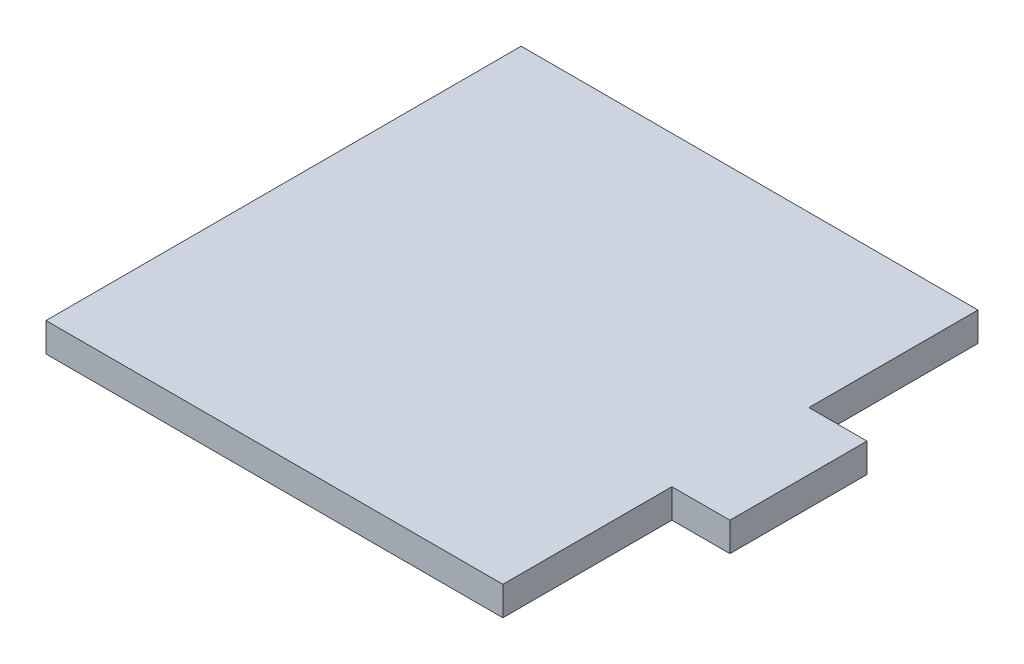
ISO-10303-21;
HEADER;
FILE_DESCRIPTION(('STEP AP214'),'2;1');
FILE_NAME('part.step','',(''),(''),'','','');
FILE_SCHEMA(('AUTOMOTIVE_DESIGN { 1 0 10303 214 1 1 1 1 }'));
ENDSEC;
DATA;
#1=APPLICATION_CONTEXT('core data for automotive mechanical design processes');
#2=APPLICATION_PROTOCOL_DEFINITION('international standard','automotive_design',2000,#1);
#3=PRODUCT_CONTEXT('',#1,'mechanical');
#4=PRODUCT('Part','Part','',(#3));
#5=PRODUCT_RELATED_PRODUCT_CATEGORY('part','',(#4));
#6=PRODUCT_DEFINITION_FORMATION('','',#4);
#7=PRODUCT_DEFINITION_CONTEXT('part definition',#1,'design');
#8=PRODUCT_DEFINITION('design','',#6,#7);
#9=PRODUCT_DEFINITION_SHAPE('','',#8);
#10=(LENGTH_UNIT() NAMED_UNIT(*) SI_UNIT(.MILLI.,.METRE.));
#11=(NAMED_UNIT(*) PLANE_ANGLE_UNIT() SI_UNIT($,.RADIAN.));
#12=(NAMED_UNIT(*) SI_UNIT($,.STERADIAN.) SOLID_ANGLE_UNIT());
#13=UNCERTAINTY_MEASURE_WITH_UNIT(LENGTH_MEASURE(1.E-05),#10,'distance_accuracy_value','');
#14=(GEOMETRIC_REPRESENTATION_CONTEXT(3) GLOBAL_UNCERTAINTY_ASSIGNED_CONTEXT((#13)) GLOBAL_UNIT_ASSIGNED_CONTEXT((#10,
#11,#12)) REPRESENTATION_CONTEXT('',''));
#15=CARTESIAN_POINT('',(0.,0.,0.));
#16=DIRECTION('',(0.,0.,1.));
#17=DIRECTION('',(1.,0.,0.));
#18=AXIS2_PLACEMENT_3D('',#15,#16,#17);
#19=CARTESIAN_POINT('',(-25.,3.175,0.));
#20=DIRECTION('',(-1.,0.,0.));
#21=DIRECTION('',(0.,0.,1.));
#22=AXIS2_PLACEMENT_3D('',#19,#20,#21);
#23=PLANE('',#22);
#24=DIRECTION('',(0.,0.,-1.));
#25=VECTOR('',#24,1.);
#26=CARTESIAN_POINT('',(-25.,0.,0.));
#27=LINE('',#26,#25);
#28=CARTESIAN_POINT('',(-25.,0.,33.5));
#29=VERTEX_POINT('',#28);
#30=CARTESIAN_POINT('',(-25.,0.,-18.5));
#31=VERTEX_POINT('',#30);
#32=EDGE_CURVE('E127',#29,#31,#27,.T.);
#33=ORIENTED_EDGE('',*,*,#32,.F.);
#34=DIRECTION('',(0.,-1.,0.));
#35=VECTOR('',#34,1.);
#36=CARTESIAN_POINT('',(-25.,3.175,33.5));
#37=LINE('',#36,#35);
#38=CARTESIAN_POINT('',(-25.,3.175,33.5));
#39=VERTEX_POINT('',#38);
#40=EDGE_CURVE('E11',#39,#29,#37,.T.);
#41=ORIENTED_EDGE('',*,*,#40,.F.);
#42=DIRECTION('',(0.,0.,-1.));
#43=VECTOR('',#42,1.);
#44=CARTESIAN_POINT('',(-25.,3.175,0.));
#45=LINE('',#44,#43);
#46=CARTESIAN_POINT('',(-25.,3.175,-18.5));
#47=VERTEX_POINT('',#46);
#48=EDGE_CURVE('E147',#39,#47,#45,.T.);
#49=ORIENTED_EDGE('',*,*,#48,.T.);
#50=DIRECTION('',(0.,-1.,0.));
#51=VECTOR('',#50,1.);
#52=CARTESIAN_POINT('',(-25.,3.175,-18.5));
#53=LINE('',#52,#51);
#54=EDGE_CURVE('E50',#47,#31,#53,.T.);
#55=ORIENTED_EDGE('',*,*,#54,.T.);
#56=EDGE_LOOP('',(#33,#41,#49,#55));
#57=FACE_BOUND('',#56,.T.);
#58=ADVANCED_FACE('F34',(#57),#23,.T.);
#59=CARTESIAN_POINT('',(0.,3.175,33.5));
#60=DIRECTION('',(0.,0.,1.));
#61=DIRECTION('',(1.,0.,0.));
#62=AXIS2_PLACEMENT_3D('',#59,#60,#61);
#63=PLANE('',#62);
#64=DIRECTION('',(-1.,0.,0.));
#65=VECTOR('',#64,1.);
#66=CARTESIAN_POINT('',(0.,0.,33.5));
#67=LINE('',#66,#65);
#68=CARTESIAN_POINT('',(25.,0.,33.5));
#69=VERTEX_POINT('',#68);
#70=EDGE_CURVE('E129',#69,#29,#67,.T.);
#71=ORIENTED_EDGE('',*,*,#70,.F.);
#72=DIRECTION('',(0.,-1.,0.));
#73=VECTOR('',#72,1.);
#74=CARTESIAN_POINT('',(25.,3.175,33.5));
#75=LINE('',#74,#73);
#76=CARTESIAN_POINT('',(25.,3.175,33.5));
#77=VERTEX_POINT('',#76);
#78=EDGE_CURVE('E42',#77,#69,#75,.T.);
#79=ORIENTED_EDGE('',*,*,#78,.F.);
#80=DIRECTION('',(-1.,0.,0.));
#81=VECTOR('',#80,1.);
#82=CARTESIAN_POINT('',(0.,3.175,33.5));
#83=LINE('',#82,#81);
#84=EDGE_CURVE('E173',#77,#39,#83,.T.);
#85=ORIENTED_EDGE('',*,*,#84,.T.);
#86=ORIENTED_EDGE('',*,*,#40,.T.);
#87=EDGE_LOOP('',(#71,#79,#85,#86));
#88=FACE_BOUND('',#87,.T.);
#89=ADVANCED_FACE('F164',(#88),#63,.T.);
#90=CARTESIAN_POINT('',(25.,3.175,0.));
#91=DIRECTION('',(1.,0.,0.));
#92=DIRECTION('',(0.,0.,-1.));
#93=AXIS2_PLACEMENT_3D('',#90,#91,#92);
#94=PLANE('',#93);
#95=DIRECTION('',(0.,0.,1.));
#96=VECTOR('',#95,1.);
#97=CARTESIAN_POINT('',(25.,0.,0.));
#98=LINE('',#97,#96);
#99=CARTESIAN_POINT('',(25.,0.,15.));
#100=VERTEX_POINT('',#99);
#101=EDGE_CURVE('E132',#100,#69,#98,.T.);
#102=ORIENTED_EDGE('',*,*,#101,.F.);
#103=DIRECTION('',(0.,-1.,0.));
#104=VECTOR('',#103,1.);
#105=CARTESIAN_POINT('',(25.,3.175,15.));
#106=LINE('',#105,#104);
#107=CARTESIAN_POINT('',(25.,3.175,15.));
#108=VERTEX_POINT('',#107);
#109=EDGE_CURVE('E153',#108,#100,#106,.T.);
#110=ORIENTED_EDGE('',*,*,#109,.F.);
#111=DIRECTION('',(0.,0.,1.));
#112=VECTOR('',#111,1.);
#113=CARTESIAN_POINT('',(25.,3.175,0.));
#114=LINE('',#113,#112);
#115=EDGE_CURVE('E160',#108,#77,#114,.T.);
#116=ORIENTED_EDGE('',*,*,#115,.T.);
#117=ORIENTED_EDGE('',*,*,#78,.T.);
#118=EDGE_LOOP('',(#102,#110,#116,#117));
#119=FACE_BOUND('',#118,.T.);
#120=ADVANCED_FACE('F158',(#119),#94,.T.);
#121=CARTESIAN_POINT('',(0.,3.175,15.));
#122=DIRECTION('',(0.,0.,1.));
#123=DIRECTION('',(1.,0.,0.));
#124=AXIS2_PLACEMENT_3D('',#121,#122,#123);
#125=PLANE('',#124);
#126=DIRECTION('',(-1.,0.,0.));
#127=VECTOR('',#126,1.);
#128=CARTESIAN_POINT('',(0.,0.,15.));
#129=LINE('',#128,#127);
#130=CARTESIAN_POINT('',(31.35,0.,15.));
#131=VERTEX_POINT('',#130);
#132=EDGE_CURVE('E135',#131,#100,#129,.T.);
#133=ORIENTED_EDGE('',*,*,#132,.F.);
#134=DIRECTION('',(0.,-1.,0.));
#135=VECTOR('',#134,1.);
#136=CARTESIAN_POINT('',(31.35,3.175,15.));
#137=LINE('',#136,#135);
#138=CARTESIAN_POINT('',(31.35,3.175,15.));
#139=VERTEX_POINT('',#138);
#140=EDGE_CURVE('E151',#139,#131,#137,.T.);
#141=ORIENTED_EDGE('',*,*,#140,.F.);
#142=DIRECTION('',(-1.,0.,0.));
#143=VECTOR('',#142,1.);
#144=CARTESIAN_POINT('',(0.,3.175,15.));
#145=LINE('',#144,#143);
#146=EDGE_CURVE('E172',#139,#108,#145,.T.);
#147=ORIENTED_EDGE('',*,*,#146,.T.);
#148=ORIENTED_EDGE('',*,*,#109,.T.);
#149=EDGE_LOOP('',(#133,#141,#147,#148));
#150=FACE_BOUND('',#149,.T.);
#151=ADVANCED_FACE('F170',(#150),#125,.T.);
#152=CARTESIAN_POINT('',(31.35,3.175,0.));
#153=DIRECTION('',(1.,0.,0.));
#154=DIRECTION('',(0.,0.,-1.));
#155=AXIS2_PLACEMENT_3D('',#152,#153,#154);
#156=PLANE('',#155);
#157=DIRECTION('',(0.,0.,1.));
#158=VECTOR('',#157,1.);
#159=CARTESIAN_POINT('',(31.35,0.,0.));
#160=LINE('',#159,#158);
#161=CARTESIAN_POINT('',(31.35,0.,0.));
#162=VERTEX_POINT('',#161);
#163=EDGE_CURVE('E138',#162,#131,#160,.T.);
#164=ORIENTED_EDGE('',*,*,#163,.F.);
#165=DIRECTION('',(0.,-1.,0.));
#166=VECTOR('',#165,1.);
#167=CARTESIAN_POINT('',(31.35,3.175,0.));
#168=LINE('',#167,#166);
#169=CARTESIAN_POINT('',(31.35,3.175,0.));
#170=VERTEX_POINT('',#169);
#171=EDGE_CURVE('E109',#170,#162,#168,.T.);
#172=ORIENTED_EDGE('',*,*,#171,.F.);
#173=DIRECTION('',(0.,0.,1.));
#174=VECTOR('',#173,1.);
#175=CARTESIAN_POINT('',(31.35,3.175,0.));
#176=LINE('',#175,#174);
#177=EDGE_CURVE('E119',#170,#139,#176,.T.);
#178=ORIENTED_EDGE('',*,*,#177,.T.);
#179=ORIENTED_EDGE('',*,*,#140,.T.);
#180=EDGE_LOOP('',(#164,#172,#178,#179));
#181=FACE_BOUND('',#180,.T.);
#182=ADVANCED_FACE('F179',(#181),#156,.T.);
#183=CARTESIAN_POINT('',(0.,3.175,0.));
#184=DIRECTION('',(0.,0.,-1.));
#185=DIRECTION('',(-1.,0.,0.));
#186=AXIS2_PLACEMENT_3D('',#183,#184,#185);
#187=PLANE('',#186);
#188=DIRECTION('',(1.,0.,0.));
#189=VECTOR('',#188,1.);
#190=CARTESIAN_POINT('',(0.,0.,0.));
#191=LINE('',#190,#189);
#192=CARTESIAN_POINT('',(25.,0.,0.));
#193=VERTEX_POINT('',#192);
#194=EDGE_CURVE('E105',#193,#162,#191,.T.);
#195=ORIENTED_EDGE('',*,*,#194,.F.);
#196=DIRECTION('',(0.,-1.,0.));
#197=VECTOR('',#196,1.);
#198=CARTESIAN_POINT('',(25.,3.175,0.));
#199=LINE('',#198,#197);
#200=CARTESIAN_POINT('',(25.,3.175,0.));
#201=VERTEX_POINT('',#200);
#202=EDGE_CURVE('E100',#201,#193,#199,.T.);
#203=ORIENTED_EDGE('',*,*,#202,.F.);
#204=DIRECTION('',(1.,0.,0.));
#205=VECTOR('',#204,1.);
#206=CARTESIAN_POINT('',(0.,3.175,0.));
#207=LINE('',#206,#205);
#208=EDGE_CURVE('E103',#201,#170,#207,.T.);
#209=ORIENTED_EDGE('',*,*,#208,.T.);
#210=ORIENTED_EDGE('',*,*,#171,.T.);
#211=EDGE_LOOP('',(#195,#203,#209,#210));
#212=FACE_BOUND('',#211,.T.);
#213=ADVANCED_FACE('F102',(#212),#187,.T.);
#214=CARTESIAN_POINT('',(25.,3.175,0.));
#215=DIRECTION('',(1.,0.,0.));
#216=DIRECTION('',(0.,0.,-1.));
#217=AXIS2_PLACEMENT_3D('',#214,#215,#216);
#218=PLANE('',#217);
#219=DIRECTION('',(0.,0.,1.));
#220=VECTOR('',#219,1.);
#221=CARTESIAN_POINT('',(25.,0.,0.));
#222=LINE('',#221,#220);
#223=CARTESIAN_POINT('',(25.,0.,-18.5));
#224=VERTEX_POINT('',#223);
#225=EDGE_CURVE('E142',#224,#193,#222,.T.);
#226=ORIENTED_EDGE('',*,*,#225,.F.);
#227=DIRECTION('',(0.,-1.,0.));
#228=VECTOR('',#227,1.);
#229=CARTESIAN_POINT('',(25.,3.175,-18.5));
#230=LINE('',#229,#228);
#231=CARTESIAN_POINT('',(25.,3.175,-18.5));
#232=VERTEX_POINT('',#231);
#233=EDGE_CURVE('E75',#232,#224,#230,.T.);
#234=ORIENTED_EDGE('',*,*,#233,.F.);
#235=DIRECTION('',(0.,0.,1.));
#236=VECTOR('',#235,1.);
#237=CARTESIAN_POINT('',(25.,3.175,0.));
#238=LINE('',#237,#236);
#239=EDGE_CURVE('E116',#232,#201,#238,.T.);
#240=ORIENTED_EDGE('',*,*,#239,.T.);
#241=ORIENTED_EDGE('',*,*,#202,.T.);
#242=EDGE_LOOP('',(#226,#234,#240,#241));
#243=FACE_BOUND('',#242,.T.);
#244=ADVANCED_FACE('F121',(#243),#218,.T.);
#245=CARTESIAN_POINT('',(0.,3.175,-18.5));
#246=DIRECTION('',(0.,0.,-1.));
#247=DIRECTION('',(-1.,0.,0.));
#248=AXIS2_PLACEMENT_3D('',#245,#246,#247);
#249=PLANE('',#248);
#250=DIRECTION('',(1.,0.,0.));
#251=VECTOR('',#250,1.);
#252=CARTESIAN_POINT('',(0.,0.,-18.5));
#253=LINE('',#252,#251);
#254=EDGE_CURVE('E144',#31,#224,#253,.T.);
#255=ORIENTED_EDGE('',*,*,#254,.F.);
#256=ORIENTED_EDGE('',*,*,#54,.F.);
#257=DIRECTION('',(1.,0.,0.));
#258=VECTOR('',#257,1.);
#259=CARTESIAN_POINT('',(0.,3.175,-18.5));
#260=LINE('',#259,#258);
#261=EDGE_CURVE('E122',#47,#232,#260,.T.);
#262=ORIENTED_EDGE('',*,*,#261,.T.);
#263=ORIENTED_EDGE('',*,*,#233,.T.);
#264=EDGE_LOOP('',(#255,#256,#262,#263));
#265=FACE_BOUND('',#264,.T.);
#266=ADVANCED_FACE('F180',(#265),#249,.T.);
#267=CARTESIAN_POINT('',(0.,3.175,0.));
#268=DIRECTION('',(0.,1.,0.));
#269=DIRECTION('',(0.,0.,1.));
#270=AXIS2_PLACEMENT_3D('',#267,#268,#269);
#271=PLANE('',#270);
#272=ORIENTED_EDGE('',*,*,#48,.F.);
#273=ORIENTED_EDGE('',*,*,#84,.F.);
#274=ORIENTED_EDGE('',*,*,#115,.F.);
#275=ORIENTED_EDGE('',*,*,#146,.F.);
#276=ORIENTED_EDGE('',*,*,#177,.F.);
#277=ORIENTED_EDGE('',*,*,#208,.F.);
#278=ORIENTED_EDGE('',*,*,#239,.F.);
#279=ORIENTED_EDGE('',*,*,#261,.F.);
#280=EDGE_LOOP('',(#272,#273,#274,#275,#276,#277,#278,#279));
#281=FACE_BOUND('',#280,.T.);
#282=ADVANCED_FACE('F114',(#281),#271,.T.);
#283=CARTESIAN_POINT('',(0.,0.,0.));
#284=DIRECTION('',(0.,1.,0.));
#285=DIRECTION('',(0.,0.,1.));
#286=AXIS2_PLACEMENT_3D('',#283,#284,#285);
#287=PLANE('',#286);
#288=ORIENTED_EDGE('',*,*,#32,.T.);
#289=ORIENTED_EDGE('',*,*,#254,.T.);
#290=ORIENTED_EDGE('',*,*,#225,.T.);
#291=ORIENTED_EDGE('',*,*,#194,.T.);
#292=ORIENTED_EDGE('',*,*,#163,.T.);
#293=ORIENTED_EDGE('',*,*,#132,.T.);
#294=ORIENTED_EDGE('',*,*,#101,.T.);
#295=ORIENTED_EDGE('',*,*,#70,.T.);
#296=EDGE_LOOP('',(#288,#289,#290,#291,#292,#293,#294,#295));
#297=FACE_BOUND('',#296,.T.);
#298=ADVANCED_FACE('F166',(#297),#287,.F.);
#299=CLOSED_SHELL('',(#58,#89,#120,#151,#182,#213,#244,#266,#282,#298));
#300=MANIFOLD_SOLID_BREP('B2',#299);
#301=ADVANCED_BREP_SHAPE_REPRESENTATION('',(#18,#300),#14);
#302=SHAPE_DEFINITION_REPRESENTATION(#9,#301);
ENDSEC;
END-ISO-10303-21;
